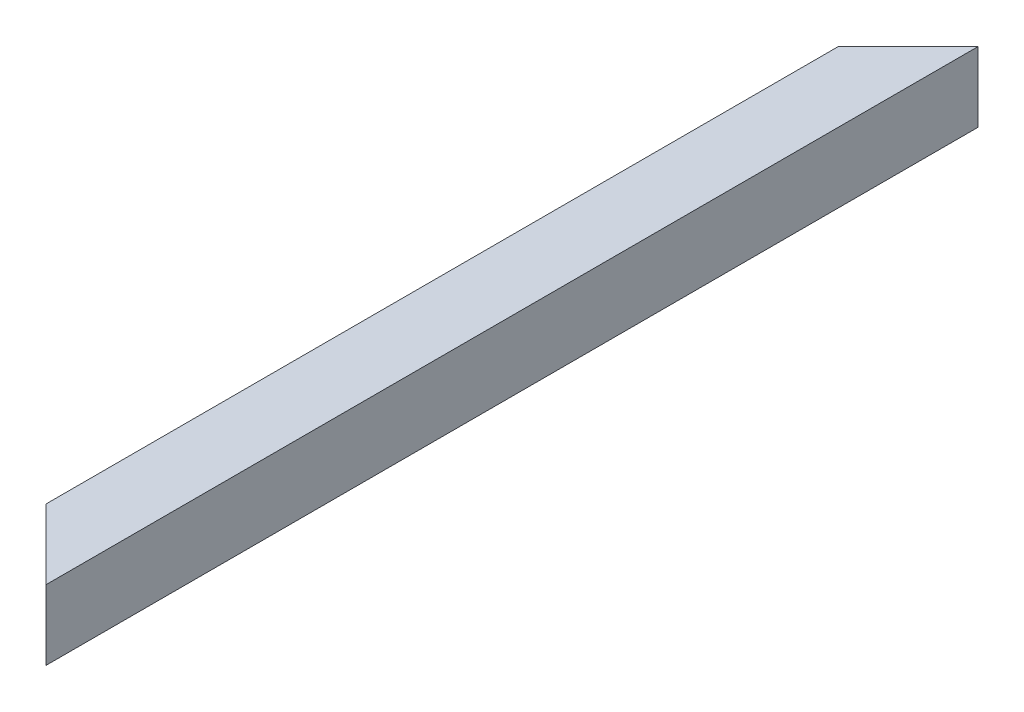
ISO-10303-21;
HEADER;
FILE_DESCRIPTION(('STEP AP214'),'2;1');
FILE_NAME('part.step','',(''),(''),'','','');
FILE_SCHEMA(('AUTOMOTIVE_DESIGN { 1 0 10303 214 1 1 1 1 }'));
ENDSEC;
DATA;
#1=APPLICATION_CONTEXT('core data for automotive mechanical design processes');
#2=APPLICATION_PROTOCOL_DEFINITION('international standard','automotive_design',2000,#1);
#3=PRODUCT_CONTEXT('',#1,'mechanical');
#4=PRODUCT('Part','Part','',(#3));
#5=PRODUCT_RELATED_PRODUCT_CATEGORY('part','',(#4));
#6=PRODUCT_DEFINITION_FORMATION('','',#4);
#7=PRODUCT_DEFINITION_CONTEXT('part definition',#1,'design');
#8=PRODUCT_DEFINITION('design','',#6,#7);
#9=PRODUCT_DEFINITION_SHAPE('','',#8);
#10=(LENGTH_UNIT() NAMED_UNIT(*) SI_UNIT(.MILLI.,.METRE.));
#11=(NAMED_UNIT(*) PLANE_ANGLE_UNIT() SI_UNIT($,.RADIAN.));
#12=(NAMED_UNIT(*) SI_UNIT($,.STERADIAN.) SOLID_ANGLE_UNIT());
#13=UNCERTAINTY_MEASURE_WITH_UNIT(LENGTH_MEASURE(1.E-05),#10,'distance_accuracy_value','');
#14=(GEOMETRIC_REPRESENTATION_CONTEXT(3) GLOBAL_UNCERTAINTY_ASSIGNED_CONTEXT((#13)) GLOBAL_UNIT_ASSIGNED_CONTEXT((#10,
#11,#12)) REPRESENTATION_CONTEXT('',''));
#15=CARTESIAN_POINT('',(0.,0.,0.));
#16=DIRECTION('',(0.,0.,1.));
#17=DIRECTION('',(1.,0.,0.));
#18=AXIS2_PLACEMENT_3D('',#15,#16,#17);
#19=CARTESIAN_POINT('',(-26.,26.,0.));
#20=DIRECTION('',(1.,0.,0.));
#21=DIRECTION('',(0.,0.,-1.));
#22=AXIS2_PLACEMENT_3D('',#19,#20,#21);
#23=PLANE('',#22);
#24=DIRECTION('',(0.,-1.,0.));
#25=VECTOR('',#24,1.);
#26=CARTESIAN_POINT('',(-26.,26.,55.9999999999994));
#27=LINE('',#26,#25);
#28=CARTESIAN_POINT('',(-26.,26.,55.9999999999994));
#29=VERTEX_POINT('',#28);
#30=CARTESIAN_POINT('',(-26.,-26.,55.9999999999994));
#31=VERTEX_POINT('',#30);
#32=EDGE_CURVE('E11',#29,#31,#27,.T.);
#33=ORIENTED_EDGE('',*,*,#32,.F.);
#34=DIRECTION('',(0.,0.,1.));
#35=VECTOR('',#34,1.);
#36=CARTESIAN_POINT('',(-26.,26.,0.));
#37=LINE('',#36,#35);
#38=CARTESIAN_POINT('',(-26.,26.,744.000000000001));
#39=VERTEX_POINT('',#38);
#40=EDGE_CURVE('E146',#29,#39,#37,.T.);
#41=ORIENTED_EDGE('',*,*,#40,.T.);
#42=DIRECTION('',(0.,1.,0.));
#43=VECTOR('',#42,1.);
#44=CARTESIAN_POINT('',(-26.,26.,744.000000000001));
#45=LINE('',#44,#43);
#46=CARTESIAN_POINT('',(-26.,-26.,744.000000000001));
#47=VERTEX_POINT('',#46);
#48=EDGE_CURVE('E44',#47,#39,#45,.T.);
#49=ORIENTED_EDGE('',*,*,#48,.F.);
#50=DIRECTION('',(0.,0.,1.));
#51=VECTOR('',#50,1.);
#52=CARTESIAN_POINT('',(-26.,-26.,0.));
#53=LINE('',#52,#51);
#54=EDGE_CURVE('E133',#31,#47,#53,.T.);
#55=ORIENTED_EDGE('',*,*,#54,.F.);
#56=EDGE_LOOP('',(#33,#41,#49,#55));
#57=FACE_BOUND('',#56,.T.);
#58=ADVANCED_FACE('F36',(#57),#23,.T.);
#59=CARTESIAN_POINT('',(-26.,-26.,0.));
#60=DIRECTION('',(0.,1.,0.));
#61=DIRECTION('',(0.,0.,1.));
#62=AXIS2_PLACEMENT_3D('',#59,#60,#61);
#63=PLANE('',#62);
#64=DIRECTION('',(0.707106781186551,0.,-0.707106781186544));
#65=VECTOR('',#64,1.);
#66=CARTESIAN_POINT('',(1.9999999999997,-26.,28.));
#67=LINE('',#66,#65);
#68=CARTESIAN_POINT('',(26.,-26.,3.99999999999995));
#69=VERTEX_POINT('',#68);
#70=EDGE_CURVE('E166',#31,#69,#67,.T.);
#71=ORIENTED_EDGE('',*,*,#70,.F.);
#72=ORIENTED_EDGE('',*,*,#54,.T.);
#73=DIRECTION('',(-0.707106781186551,0.,-0.707106781186544));
#74=VECTOR('',#73,1.);
#75=CARTESIAN_POINT('',(-398.,-26.,372.000000000004));
#76=LINE('',#75,#74);
#77=CARTESIAN_POINT('',(26.,-26.,796.));
#78=VERTEX_POINT('',#77);
#79=EDGE_CURVE('E58',#78,#47,#76,.T.);
#80=ORIENTED_EDGE('',*,*,#79,.F.);
#81=DIRECTION('',(0.,0.,1.));
#82=VECTOR('',#81,1.);
#83=CARTESIAN_POINT('',(26.,-26.,0.));
#84=LINE('',#83,#82);
#85=EDGE_CURVE('E136',#69,#78,#84,.T.);
#86=ORIENTED_EDGE('',*,*,#85,.F.);
#87=EDGE_LOOP('',(#71,#72,#80,#86));
#88=FACE_BOUND('',#87,.T.);
#89=ADVANCED_FACE('F182',(#88),#63,.T.);
#90=CARTESIAN_POINT('',(26.,26.,0.));
#91=DIRECTION('',(-1.,0.,0.));
#92=DIRECTION('',(0.,0.,1.));
#93=AXIS2_PLACEMENT_3D('',#90,#91,#92);
#94=PLANE('',#93);
#95=DIRECTION('',(0.,1.,0.));
#96=VECTOR('',#95,1.);
#97=CARTESIAN_POINT('',(26.,26.,3.99999999999995));
#98=LINE('',#97,#96);
#99=CARTESIAN_POINT('',(26.,26.,3.99999999999995));
#100=VERTEX_POINT('',#99);
#101=EDGE_CURVE('E168',#69,#100,#98,.T.);
#102=ORIENTED_EDGE('',*,*,#101,.F.);
#103=ORIENTED_EDGE('',*,*,#85,.T.);
#104=DIRECTION('',(0.,-1.,0.));
#105=VECTOR('',#104,1.);
#106=CARTESIAN_POINT('',(26.,26.,796.));
#107=LINE('',#106,#105);
#108=CARTESIAN_POINT('',(26.,26.,796.));
#109=VERTEX_POINT('',#108);
#110=EDGE_CURVE('E162',#109,#78,#107,.T.);
#111=ORIENTED_EDGE('',*,*,#110,.F.);
#112=DIRECTION('',(0.,0.,1.));
#113=VECTOR('',#112,1.);
#114=CARTESIAN_POINT('',(26.,26.,0.));
#115=LINE('',#114,#113);
#116=EDGE_CURVE('E142',#100,#109,#115,.T.);
#117=ORIENTED_EDGE('',*,*,#116,.F.);
#118=EDGE_LOOP('',(#102,#103,#111,#117));
#119=FACE_BOUND('',#118,.T.);
#120=ADVANCED_FACE('F179',(#119),#94,.T.);
#121=CARTESIAN_POINT('',(-26.,26.,0.));
#122=DIRECTION('',(0.,-1.,0.));
#123=DIRECTION('',(0.,0.,-1.));
#124=AXIS2_PLACEMENT_3D('',#121,#122,#123);
#125=PLANE('',#124);
#126=DIRECTION('',(-0.707106781186551,0.,0.707106781186544));
#127=VECTOR('',#126,1.);
#128=CARTESIAN_POINT('',(1.9999999999997,26.,28.));
#129=LINE('',#128,#127);
#130=EDGE_CURVE('E50',#100,#29,#129,.T.);
#131=ORIENTED_EDGE('',*,*,#130,.F.);
#132=ORIENTED_EDGE('',*,*,#116,.T.);
#133=DIRECTION('',(0.707106781186551,0.,0.707106781186544));
#134=VECTOR('',#133,1.);
#135=CARTESIAN_POINT('',(-398.,26.,372.000000000004));
#136=LINE('',#135,#134);
#137=EDGE_CURVE('E164',#39,#109,#136,.T.);
#138=ORIENTED_EDGE('',*,*,#137,.F.);
#139=ORIENTED_EDGE('',*,*,#40,.F.);
#140=EDGE_LOOP('',(#131,#132,#138,#139));
#141=FACE_BOUND('',#140,.T.);
#142=ADVANCED_FACE('F174',(#141),#125,.T.);
#143=CARTESIAN_POINT('',(30.,-30.,800.));
#144=DIRECTION('',(0.707106781186544,0.,-0.707106781186551));
#145=DIRECTION('',(-0.707106781186551,0.,-0.707106781186544));
#146=AXIS2_PLACEMENT_3D('',#143,#144,#145);
#147=PLANE('',#146);
#148=ORIENTED_EDGE('',*,*,#137,.T.);
#149=ORIENTED_EDGE('',*,*,#110,.T.);
#150=ORIENTED_EDGE('',*,*,#79,.T.);
#151=ORIENTED_EDGE('',*,*,#48,.T.);
#152=EDGE_LOOP('',(#148,#149,#150,#151));
#153=FACE_BOUND('',#152,.T.);
#154=DIRECTION('',(-0.707106781186551,0.,-0.707106781186544));
#155=VECTOR('',#154,1.);
#156=CARTESIAN_POINT('',(30.,30.,800.));
#157=LINE('',#156,#155);
#158=CARTESIAN_POINT('',(30.,30.,800.));
#159=VERTEX_POINT('',#158);
#160=CARTESIAN_POINT('',(-30.,30.,740.000000000001));
#161=VERTEX_POINT('',#160);
#162=EDGE_CURVE('E155',#159,#161,#157,.T.);
#163=ORIENTED_EDGE('',*,*,#162,.T.);
#164=DIRECTION('',(0.,1.,0.));
#165=VECTOR('',#164,1.);
#166=CARTESIAN_POINT('',(-30.,-30.,740.000000000001));
#167=LINE('',#166,#165);
#168=CARTESIAN_POINT('',(-30.,-30.,740.000000000001));
#169=VERTEX_POINT('',#168);
#170=EDGE_CURVE('E157',#169,#161,#167,.T.);
#171=ORIENTED_EDGE('',*,*,#170,.F.);
#172=DIRECTION('',(-0.707106781186551,0.,-0.707106781186544));
#173=VECTOR('',#172,1.);
#174=CARTESIAN_POINT('',(30.,-30.,800.));
#175=LINE('',#174,#173);
#176=CARTESIAN_POINT('',(30.,-30.,800.));
#177=VERTEX_POINT('',#176);
#178=EDGE_CURVE('E123',#177,#169,#175,.T.);
#179=ORIENTED_EDGE('',*,*,#178,.F.);
#180=DIRECTION('',(0.,1.,0.));
#181=VECTOR('',#180,1.);
#182=CARTESIAN_POINT('',(30.,30.,800.));
#183=LINE('',#182,#181);
#184=EDGE_CURVE('E145',#177,#159,#183,.T.);
#185=ORIENTED_EDGE('',*,*,#184,.T.);
#186=EDGE_LOOP('',(#163,#171,#179,#185));
#187=FACE_BOUND('',#186,.T.);
#188=ADVANCED_FACE('F181',(#153,#187),#147,.F.);
#189=CARTESIAN_POINT('',(30.,-30.,0.));
#190=DIRECTION('',(0.707106781186544,0.,0.707106781186551));
#191=DIRECTION('',(0.707106781186551,0.,-0.707106781186544));
#192=AXIS2_PLACEMENT_3D('',#189,#190,#191);
#193=PLANE('',#192);
#194=ORIENTED_EDGE('',*,*,#130,.T.);
#195=ORIENTED_EDGE('',*,*,#32,.T.);
#196=ORIENTED_EDGE('',*,*,#70,.T.);
#197=ORIENTED_EDGE('',*,*,#101,.T.);
#198=EDGE_LOOP('',(#194,#195,#196,#197));
#199=FACE_BOUND('',#198,.T.);
#200=DIRECTION('',(0.707106781186551,0.,-0.707106781186544));
#201=VECTOR('',#200,1.);
#202=CARTESIAN_POINT('',(30.,30.,0.));
#203=LINE('',#202,#201);
#204=CARTESIAN_POINT('',(-30.,30.,59.9999999999994));
#205=VERTEX_POINT('',#204);
#206=CARTESIAN_POINT('',(30.,30.,0.));
#207=VERTEX_POINT('',#206);
#208=EDGE_CURVE('E110',#205,#207,#203,.T.);
#209=ORIENTED_EDGE('',*,*,#208,.T.);
#210=DIRECTION('',(0.,1.,0.));
#211=VECTOR('',#210,1.);
#212=CARTESIAN_POINT('',(30.,30.,0.));
#213=LINE('',#212,#211);
#214=CARTESIAN_POINT('',(30.,-30.,0.));
#215=VERTEX_POINT('',#214);
#216=EDGE_CURVE('E105',#215,#207,#213,.T.);
#217=ORIENTED_EDGE('',*,*,#216,.F.);
#218=DIRECTION('',(0.707106781186551,0.,-0.707106781186544));
#219=VECTOR('',#218,1.);
#220=CARTESIAN_POINT('',(30.,-30.,0.));
#221=LINE('',#220,#219);
#222=CARTESIAN_POINT('',(-30.,-30.,59.9999999999994));
#223=VERTEX_POINT('',#222);
#224=EDGE_CURVE('E99',#223,#215,#221,.T.);
#225=ORIENTED_EDGE('',*,*,#224,.F.);
#226=DIRECTION('',(0.,1.,0.));
#227=VECTOR('',#226,1.);
#228=CARTESIAN_POINT('',(-30.,-30.,59.9999999999994));
#229=LINE('',#228,#227);
#230=EDGE_CURVE('E102',#223,#205,#229,.T.);
#231=ORIENTED_EDGE('',*,*,#230,.T.);
#232=EDGE_LOOP('',(#209,#217,#225,#231));
#233=FACE_BOUND('',#232,.T.);
#234=ADVANCED_FACE('F101',(#199,#233),#193,.F.);
#235=CARTESIAN_POINT('',(-30.,30.,0.));
#236=DIRECTION('',(-1.,0.,0.));
#237=DIRECTION('',(0.,0.,1.));
#238=AXIS2_PLACEMENT_3D('',#235,#236,#237);
#239=PLANE('',#238);
#240=ORIENTED_EDGE('',*,*,#230,.F.);
#241=DIRECTION('',(0.,0.,1.));
#242=VECTOR('',#241,1.);
#243=CARTESIAN_POINT('',(-30.,-30.,0.));
#244=LINE('',#243,#242);
#245=EDGE_CURVE('E117',#223,#169,#244,.T.);
#246=ORIENTED_EDGE('',*,*,#245,.T.);
#247=ORIENTED_EDGE('',*,*,#170,.T.);
#248=DIRECTION('',(0.,0.,1.));
#249=VECTOR('',#248,1.);
#250=CARTESIAN_POINT('',(-30.,30.,0.));
#251=LINE('',#250,#249);
#252=EDGE_CURVE('E119',#205,#161,#251,.T.);
#253=ORIENTED_EDGE('',*,*,#252,.F.);
#254=EDGE_LOOP('',(#240,#246,#247,#253));
#255=FACE_BOUND('',#254,.T.);
#256=ADVANCED_FACE('F115',(#255),#239,.T.);
#257=CARTESIAN_POINT('',(-30.,-30.,0.));
#258=DIRECTION('',(0.,-1.,0.));
#259=DIRECTION('',(0.,0.,-1.));
#260=AXIS2_PLACEMENT_3D('',#257,#258,#259);
#261=PLANE('',#260);
#262=ORIENTED_EDGE('',*,*,#224,.T.);
#263=DIRECTION('',(0.,0.,1.));
#264=VECTOR('',#263,1.);
#265=CARTESIAN_POINT('',(30.,-30.,0.));
#266=LINE('',#265,#264);
#267=EDGE_CURVE('E124',#215,#177,#266,.T.);
#268=ORIENTED_EDGE('',*,*,#267,.T.);
#269=ORIENTED_EDGE('',*,*,#178,.T.);
#270=ORIENTED_EDGE('',*,*,#245,.F.);
#271=EDGE_LOOP('',(#262,#268,#269,#270));
#272=FACE_BOUND('',#271,.T.);
#273=ADVANCED_FACE('F122',(#272),#261,.T.);
#274=CARTESIAN_POINT('',(30.,30.,0.));
#275=DIRECTION('',(1.,0.,0.));
#276=DIRECTION('',(0.,0.,-1.));
#277=AXIS2_PLACEMENT_3D('',#274,#275,#276);
#278=PLANE('',#277);
#279=DIRECTION('',(0.,0.,1.));
#280=VECTOR('',#279,1.);
#281=CARTESIAN_POINT('',(30.,30.,0.));
#282=LINE('',#281,#280);
#283=EDGE_CURVE('E126',#207,#159,#282,.T.);
#284=ORIENTED_EDGE('',*,*,#283,.T.);
#285=ORIENTED_EDGE('',*,*,#184,.F.);
#286=ORIENTED_EDGE('',*,*,#267,.F.);
#287=ORIENTED_EDGE('',*,*,#216,.T.);
#288=EDGE_LOOP('',(#284,#285,#286,#287));
#289=FACE_BOUND('',#288,.T.);
#290=ADVANCED_FACE('F153',(#289),#278,.T.);
#291=CARTESIAN_POINT('',(-30.,30.,0.));
#292=DIRECTION('',(0.,1.,0.));
#293=DIRECTION('',(0.,0.,1.));
#294=AXIS2_PLACEMENT_3D('',#291,#292,#293);
#295=PLANE('',#294);
#296=ORIENTED_EDGE('',*,*,#208,.F.);
#297=ORIENTED_EDGE('',*,*,#252,.T.);
#298=ORIENTED_EDGE('',*,*,#162,.F.);
#299=ORIENTED_EDGE('',*,*,#283,.F.);
#300=EDGE_LOOP('',(#296,#297,#298,#299));
#301=FACE_BOUND('',#300,.T.);
#302=ADVANCED_FACE('F38',(#301),#295,.T.);
#303=CLOSED_SHELL('',(#58,#89,#120,#142,#188,#234,#256,#273,#290,#302));
#304=MANIFOLD_SOLID_BREP('B2',#303);
#305=ADVANCED_BREP_SHAPE_REPRESENTATION('',(#18,#304),#14);
#306=SHAPE_DEFINITION_REPRESENTATION(#9,#305);
ENDSEC;
END-ISO-10303-21;
